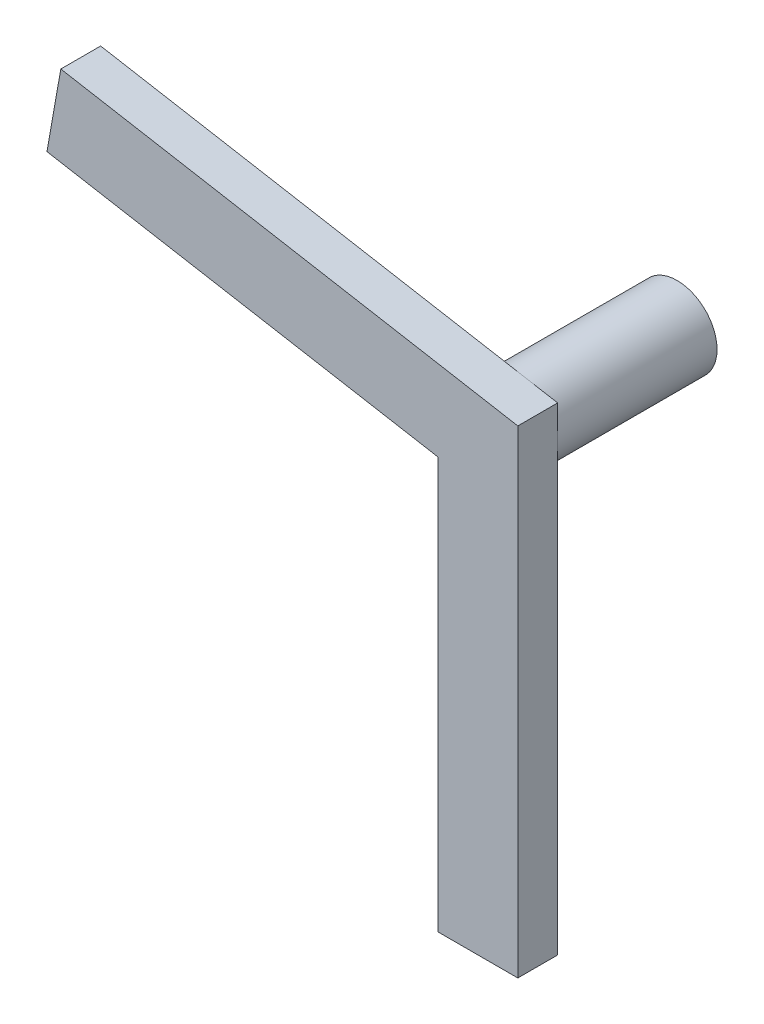
ISO-10303-21;
HEADER;
FILE_DESCRIPTION(('STEP AP214'),'2;1');
FILE_NAME('part.step','',(''),(''),'','','');
FILE_SCHEMA(('AUTOMOTIVE_DESIGN { 1 0 10303 214 1 1 1 1 }'));
ENDSEC;
DATA;
#1=APPLICATION_CONTEXT('core data for automotive mechanical design processes');
#2=APPLICATION_PROTOCOL_DEFINITION('international standard','automotive_design',2000,#1);
#3=PRODUCT_CONTEXT('',#1,'mechanical');
#4=PRODUCT('Part','Part','',(#3));
#5=PRODUCT_RELATED_PRODUCT_CATEGORY('part','',(#4));
#6=PRODUCT_DEFINITION_FORMATION('','',#4);
#7=PRODUCT_DEFINITION_CONTEXT('part definition',#1,'design');
#8=PRODUCT_DEFINITION('design','',#6,#7);
#9=PRODUCT_DEFINITION_SHAPE('','',#8);
#10=(LENGTH_UNIT() NAMED_UNIT(*) SI_UNIT(.MILLI.,.METRE.));
#11=(NAMED_UNIT(*) PLANE_ANGLE_UNIT() SI_UNIT($,.RADIAN.));
#12=(NAMED_UNIT(*) SI_UNIT($,.STERADIAN.) SOLID_ANGLE_UNIT());
#13=UNCERTAINTY_MEASURE_WITH_UNIT(LENGTH_MEASURE(1.E-05),#10,'distance_accuracy_value','');
#14=(GEOMETRIC_REPRESENTATION_CONTEXT(3) GLOBAL_UNCERTAINTY_ASSIGNED_CONTEXT((#13)) GLOBAL_UNIT_ASSIGNED_CONTEXT((#10,
#11,#12)) REPRESENTATION_CONTEXT('',''));
#15=CARTESIAN_POINT('',(0.,0.,0.));
#16=DIRECTION('',(0.,0.,1.));
#17=DIRECTION('',(1.,0.,0.));
#18=AXIS2_PLACEMENT_3D('',#15,#16,#17);
#19=CARTESIAN_POINT('',(0.,0.,0.));
#20=DIRECTION('',(0.,0.,1.));
#21=DIRECTION('',(1.,0.,0.));
#22=AXIS2_PLACEMENT_3D('',#19,#20,#21);
#23=PLANE('',#22);
#24=CARTESIAN_POINT('',(0.,0.,0.));
#25=DIRECTION('',(0.,0.,-1.));
#26=DIRECTION('',(-1.,0.,0.));
#27=AXIS2_PLACEMENT_3D('',#24,#25,#26);
#28=CIRCLE('',#27,5.);
#29=CARTESIAN_POINT('',(0.868240888334632,4.92403876506104,0.));
#30=VERTEX_POINT('',#29);
#31=CARTESIAN_POINT('',(5.,0.,0.));
#32=VERTEX_POINT('',#31);
#33=EDGE_CURVE('E45',#30,#32,#28,.T.);
#34=ORIENTED_EDGE('',*,*,#33,.F.);
#35=DIRECTION('',(0.984807753012209,-0.173648177666926,0.));
#36=VECTOR('',#35,1.);
#37=CARTESIAN_POINT('',(0.868240888334633,4.92403876506105,0.));
#38=LINE('',#37,#36);
#39=CARTESIAN_POINT('',(5.,4.19549815588643,0.));
#40=VERTEX_POINT('',#39);
#41=EDGE_CURVE('E134',#30,#40,#38,.T.);
#42=ORIENTED_EDGE('',*,*,#41,.T.);
#43=DIRECTION('',(0.,-1.,0.));
#44=VECTOR('',#43,1.);
#45=CARTESIAN_POINT('',(5.,0.,0.));
#46=LINE('',#45,#44);
#47=EDGE_CURVE('E131',#40,#32,#46,.T.);
#48=ORIENTED_EDGE('',*,*,#47,.T.);
#49=EDGE_LOOP('',(#34,#42,#48));
#50=FACE_BOUND('',#49,.T.);
#51=ADVANCED_FACE('F35',(#50),#23,.F.);
#52=EDGE_CURVE('E11',#32,#30,#28,.T.);
#53=ORIENTED_EDGE('',*,*,#52,.F.);
#54=CARTESIAN_POINT('',(5.00000000000001,-55.8045018441136,0.));
#55=VERTEX_POINT('',#54);
#56=EDGE_CURVE('E83',#32,#55,#46,.T.);
#57=ORIENTED_EDGE('',*,*,#56,.T.);
#58=DIRECTION('',(1.,0.,0.));
#59=VECTOR('',#58,1.);
#60=CARTESIAN_POINT('',(0.,-55.8045018441136,0.));
#61=LINE('',#60,#59);
#62=CARTESIAN_POINT('',(-4.99999999999999,-55.8045018441136,0.));
#63=VERTEX_POINT('',#62);
#64=EDGE_CURVE('E143',#63,#55,#61,.T.);
#65=ORIENTED_EDGE('',*,*,#64,.F.);
#66=DIRECTION('',(0.,-1.,0.));
#67=VECTOR('',#66,1.);
#68=CARTESIAN_POINT('',(-5.,0.,0.));
#69=LINE('',#68,#67);
#70=CARTESIAN_POINT('',(-5.,-4.19549815588642,0.));
#71=VERTEX_POINT('',#70);
#72=EDGE_CURVE('E141',#71,#63,#69,.T.);
#73=ORIENTED_EDGE('',*,*,#72,.F.);
#74=DIRECTION('',(-0.984807753012209,0.173648177666927,0.));
#75=VECTOR('',#74,1.);
#76=CARTESIAN_POINT('',(-0.868240888334633,-4.92403876506104,0.));
#77=LINE('',#76,#75);
#78=CARTESIAN_POINT('',(-54.0884651807325,4.46012269704456,0.));
#79=VERTEX_POINT('',#78);
#80=EDGE_CURVE('E108',#71,#79,#77,.T.);
#81=ORIENTED_EDGE('',*,*,#80,.T.);
#82=DIRECTION('',(0.173648177666927,0.984807753012209,0.));
#83=VECTOR('',#82,1.);
#84=CARTESIAN_POINT('',(-53.2202242923979,9.38416146210563,0.));
#85=LINE('',#84,#83);
#86=CARTESIAN_POINT('',(-52.3519834040633,14.3082002271666,0.));
#87=VERTEX_POINT('',#86);
#88=EDGE_CURVE('E137',#79,#87,#85,.T.);
#89=ORIENTED_EDGE('',*,*,#88,.T.);
#90=EDGE_CURVE('E135',#87,#30,#38,.T.);
#91=ORIENTED_EDGE('',*,*,#90,.T.);
#92=EDGE_LOOP('',(#53,#57,#65,#73,#81,#89,#91));
#93=FACE_BOUND('',#92,.T.);
#94=ADVANCED_FACE('F167',(#93),#23,.F.);
#95=CARTESIAN_POINT('',(5.,0.,5.));
#96=DIRECTION('',(1.,0.,0.));
#97=DIRECTION('',(0.,1.,0.));
#98=AXIS2_PLACEMENT_3D('',#95,#96,#97);
#99=PLANE('',#98);
#100=ORIENTED_EDGE('',*,*,#47,.F.);
#101=DIRECTION('',(0.,0.,-1.));
#102=VECTOR('',#101,1.);
#103=CARTESIAN_POINT('',(5.,4.19549815588643,5.));
#104=LINE('',#103,#102);
#105=CARTESIAN_POINT('',(5.,4.19549815588643,5.));
#106=VERTEX_POINT('',#105);
#107=EDGE_CURVE('E39',#106,#40,#104,.T.);
#108=ORIENTED_EDGE('',*,*,#107,.F.);
#109=DIRECTION('',(0.,-1.,0.));
#110=VECTOR('',#109,1.);
#111=CARTESIAN_POINT('',(5.,0.,5.));
#112=LINE('',#111,#110);
#113=CARTESIAN_POINT('',(5.00000000000001,-55.8045018441136,5.));
#114=VERTEX_POINT('',#113);
#115=EDGE_CURVE('E146',#106,#114,#112,.T.);
#116=ORIENTED_EDGE('',*,*,#115,.T.);
#117=DIRECTION('',(0.,0.,-1.));
#118=VECTOR('',#117,1.);
#119=CARTESIAN_POINT('',(5.00000000000001,-55.8045018441136,5.));
#120=LINE('',#119,#118);
#121=EDGE_CURVE('E130',#114,#55,#120,.T.);
#122=ORIENTED_EDGE('',*,*,#121,.T.);
#123=ORIENTED_EDGE('',*,*,#56,.F.);
#124=EDGE_LOOP('',(#100,#108,#116,#122,#123));
#125=FACE_BOUND('',#124,.T.);
#126=ADVANCED_FACE('F37',(#125),#99,.T.);
#127=CARTESIAN_POINT('',(0.868240888334633,4.92403876506105,5.));
#128=DIRECTION('',(0.173648177666926,0.984807753012209,0.));
#129=DIRECTION('',(-0.984807753012209,0.173648177666926,0.));
#130=AXIS2_PLACEMENT_3D('',#127,#128,#129);
#131=PLANE('',#130);
#132=ORIENTED_EDGE('',*,*,#90,.F.);
#133=DIRECTION('',(0.,0.,-1.));
#134=VECTOR('',#133,1.);
#135=CARTESIAN_POINT('',(-52.3519834040633,14.3082002271666,5.));
#136=LINE('',#135,#134);
#137=CARTESIAN_POINT('',(-52.3519834040633,14.3082002271666,5.));
#138=VERTEX_POINT('',#137);
#139=EDGE_CURVE('E149',#138,#87,#136,.T.);
#140=ORIENTED_EDGE('',*,*,#139,.F.);
#141=DIRECTION('',(0.984807753012209,-0.173648177666926,0.));
#142=VECTOR('',#141,1.);
#143=CARTESIAN_POINT('',(0.868240888334633,4.92403876506105,5.));
#144=LINE('',#143,#142);
#145=EDGE_CURVE('E125',#138,#106,#144,.T.);
#146=ORIENTED_EDGE('',*,*,#145,.T.);
#147=ORIENTED_EDGE('',*,*,#107,.T.);
#148=ORIENTED_EDGE('',*,*,#41,.F.);
#149=EDGE_LOOP('',(#132,#140,#146,#147,#148));
#150=FACE_BOUND('',#149,.T.);
#151=ADVANCED_FACE('F156',(#150),#131,.T.);
#152=CARTESIAN_POINT('',(-53.2202242923979,9.38416146210563,5.));
#153=DIRECTION('',(-0.984807753012209,0.173648177666927,0.));
#154=DIRECTION('',(-0.173648177666927,-0.984807753012209,0.));
#155=AXIS2_PLACEMENT_3D('',#152,#153,#154);
#156=PLANE('',#155);
#157=ORIENTED_EDGE('',*,*,#88,.F.);
#158=DIRECTION('',(0.,0.,-1.));
#159=VECTOR('',#158,1.);
#160=CARTESIAN_POINT('',(-54.0884651807325,4.46012269704456,5.));
#161=LINE('',#160,#159);
#162=CARTESIAN_POINT('',(-54.0884651807325,4.46012269704456,5.));
#163=VERTEX_POINT('',#162);
#164=EDGE_CURVE('E111',#163,#79,#161,.T.);
#165=ORIENTED_EDGE('',*,*,#164,.F.);
#166=DIRECTION('',(0.173648177666927,0.984807753012209,0.));
#167=VECTOR('',#166,1.);
#168=CARTESIAN_POINT('',(-53.2202242923979,9.38416146210563,5.));
#169=LINE('',#168,#167);
#170=EDGE_CURVE('E123',#163,#138,#169,.T.);
#171=ORIENTED_EDGE('',*,*,#170,.T.);
#172=ORIENTED_EDGE('',*,*,#139,.T.);
#173=EDGE_LOOP('',(#157,#165,#171,#172));
#174=FACE_BOUND('',#173,.T.);
#175=ADVANCED_FACE('F166',(#174),#156,.T.);
#176=CARTESIAN_POINT('',(-0.868240888334633,-4.92403876506104,5.));
#177=DIRECTION('',(-0.173648177666927,-0.984807753012209,0.));
#178=DIRECTION('',(0.984807753012209,-0.173648177666927,0.));
#179=AXIS2_PLACEMENT_3D('',#176,#177,#178);
#180=PLANE('',#179);
#181=ORIENTED_EDGE('',*,*,#80,.F.);
#182=DIRECTION('',(0.,0.,-1.));
#183=VECTOR('',#182,1.);
#184=CARTESIAN_POINT('',(-5.,-4.19549815588642,5.));
#185=LINE('',#184,#183);
#186=CARTESIAN_POINT('',(-5.,-4.19549815588642,5.));
#187=VERTEX_POINT('',#186);
#188=EDGE_CURVE('E102',#187,#71,#185,.T.);
#189=ORIENTED_EDGE('',*,*,#188,.F.);
#190=DIRECTION('',(-0.984807753012209,0.173648177666927,0.));
#191=VECTOR('',#190,1.);
#192=CARTESIAN_POINT('',(-0.868240888334633,-4.92403876506104,5.));
#193=LINE('',#192,#191);
#194=EDGE_CURVE('E106',#187,#163,#193,.T.);
#195=ORIENTED_EDGE('',*,*,#194,.T.);
#196=ORIENTED_EDGE('',*,*,#164,.T.);
#197=EDGE_LOOP('',(#181,#189,#195,#196));
#198=FACE_BOUND('',#197,.T.);
#199=ADVANCED_FACE('F104',(#198),#180,.T.);
#200=CARTESIAN_POINT('',(-5.,0.,5.));
#201=DIRECTION('',(1.,0.,0.));
#202=DIRECTION('',(0.,1.,0.));
#203=AXIS2_PLACEMENT_3D('',#200,#201,#202);
#204=PLANE('',#203);
#205=ORIENTED_EDGE('',*,*,#72,.T.);
#206=DIRECTION('',(0.,0.,-1.));
#207=VECTOR('',#206,1.);
#208=CARTESIAN_POINT('',(-4.99999999999999,-55.8045018441136,5.));
#209=LINE('',#208,#207);
#210=CARTESIAN_POINT('',(-4.99999999999999,-55.8045018441136,5.));
#211=VERTEX_POINT('',#210);
#212=EDGE_CURVE('E112',#211,#63,#209,.T.);
#213=ORIENTED_EDGE('',*,*,#212,.F.);
#214=DIRECTION('',(0.,-1.,0.));
#215=VECTOR('',#214,1.);
#216=CARTESIAN_POINT('',(-5.,0.,5.));
#217=LINE('',#216,#215);
#218=EDGE_CURVE('E115',#187,#211,#217,.T.);
#219=ORIENTED_EDGE('',*,*,#218,.F.);
#220=ORIENTED_EDGE('',*,*,#188,.T.);
#221=EDGE_LOOP('',(#205,#213,#219,#220));
#222=FACE_BOUND('',#221,.T.);
#223=ADVANCED_FACE('F116',(#222),#204,.F.);
#224=CARTESIAN_POINT('',(0.,-55.8045018441136,5.));
#225=DIRECTION('',(0.,1.,0.));
#226=DIRECTION('',(0.,0.,1.));
#227=AXIS2_PLACEMENT_3D('',#224,#225,#226);
#228=PLANE('',#227);
#229=ORIENTED_EDGE('',*,*,#64,.T.);
#230=ORIENTED_EDGE('',*,*,#121,.F.);
#231=DIRECTION('',(1.,0.,0.));
#232=VECTOR('',#231,1.);
#233=CARTESIAN_POINT('',(0.,-55.8045018441136,5.));
#234=LINE('',#233,#232);
#235=EDGE_CURVE('E59',#211,#114,#234,.T.);
#236=ORIENTED_EDGE('',*,*,#235,.F.);
#237=ORIENTED_EDGE('',*,*,#212,.T.);
#238=EDGE_LOOP('',(#229,#230,#236,#237));
#239=FACE_BOUND('',#238,.T.);
#240=ADVANCED_FACE('F169',(#239),#228,.F.);
#241=CARTESIAN_POINT('',(0.,0.,5.));
#242=DIRECTION('',(0.,0.,1.));
#243=DIRECTION('',(1.,0.,0.));
#244=AXIS2_PLACEMENT_3D('',#241,#242,#243);
#245=PLANE('',#244);
#246=ORIENTED_EDGE('',*,*,#115,.F.);
#247=ORIENTED_EDGE('',*,*,#145,.F.);
#248=ORIENTED_EDGE('',*,*,#170,.F.);
#249=ORIENTED_EDGE('',*,*,#194,.F.);
#250=ORIENTED_EDGE('',*,*,#218,.T.);
#251=ORIENTED_EDGE('',*,*,#235,.T.);
#252=EDGE_LOOP('',(#246,#247,#248,#249,#250,#251));
#253=FACE_BOUND('',#252,.T.);
#254=ADVANCED_FACE('F120',(#253),#245,.T.);
#255=CARTESIAN_POINT('',(0.,0.,-20.));
#256=DIRECTION('',(0.,0.,1.));
#257=DIRECTION('',(1.,0.,0.));
#258=AXIS2_PLACEMENT_3D('',#255,#256,#257);
#259=CYLINDRICAL_SURFACE('',#258,5.);
#260=CARTESIAN_POINT('',(0.,0.,-20.));
#261=DIRECTION('',(0.,0.,-1.));
#262=DIRECTION('',(-1.,0.,0.));
#263=AXIS2_PLACEMENT_3D('',#260,#261,#262);
#264=CIRCLE('',#263,5.);
#265=CARTESIAN_POINT('',(-5.,0.,-20.));
#266=VERTEX_POINT('',#265);
#267=EDGE_CURVE('E162',#266,#266,#264,.T.);
#268=ORIENTED_EDGE('',*,*,#267,.F.);
#269=EDGE_LOOP('',(#268));
#270=FACE_BOUND('',#269,.T.);
#271=ORIENTED_EDGE('',*,*,#33,.T.);
#272=ORIENTED_EDGE('',*,*,#52,.T.);
#273=EDGE_LOOP('',(#271,#272));
#274=FACE_BOUND('',#273,.T.);
#275=ADVANCED_FACE('F161',(#270,#274),#259,.T.);
#276=CARTESIAN_POINT('',(0.,0.,-20.));
#277=DIRECTION('',(0.,0.,-1.));
#278=DIRECTION('',(-1.,0.,0.));
#279=AXIS2_PLACEMENT_3D('',#276,#277,#278);
#280=PLANE('',#279);
#281=ORIENTED_EDGE('',*,*,#267,.T.);
#282=EDGE_LOOP('',(#281));
#283=FACE_BOUND('',#282,.T.);
#284=ADVANCED_FACE('F186',(#283),#280,.T.);
#285=CLOSED_SHELL('',(#51,#94,#126,#151,#175,#199,#223,#240,#254,#275,#284));
#286=MANIFOLD_SOLID_BREP('B2',#285);
#287=ADVANCED_BREP_SHAPE_REPRESENTATION('',(#18,#286),#14);
#288=SHAPE_DEFINITION_REPRESENTATION(#9,#287);
ENDSEC;
END-ISO-10303-21;
